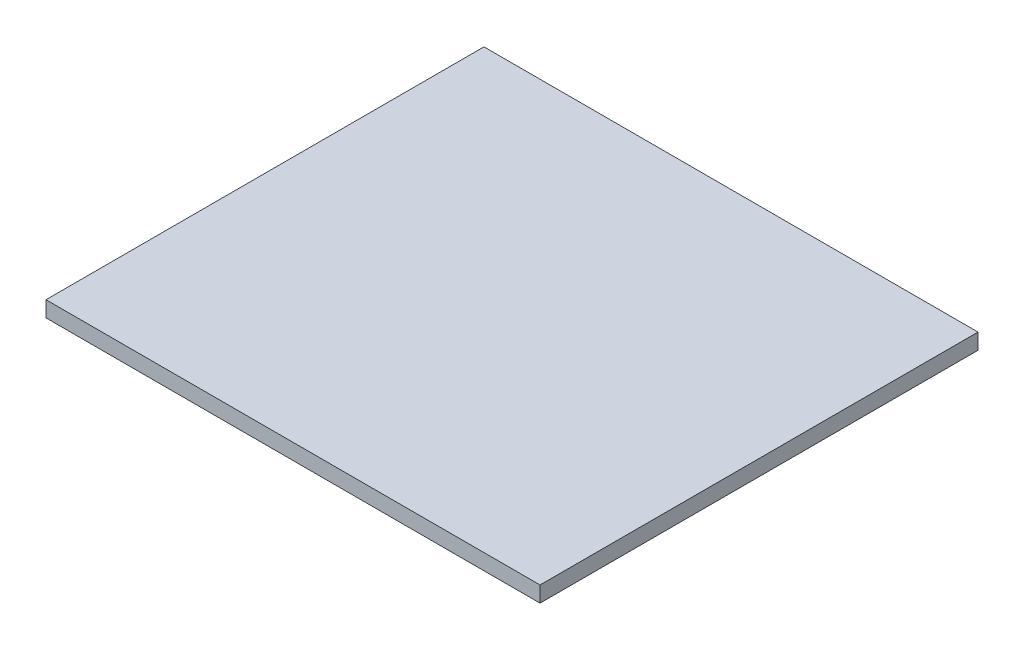
ISO-10303-21;
HEADER;
FILE_DESCRIPTION(('STEP AP214'),'2;1');
FILE_NAME('part.step','',(''),(''),'','','');
FILE_SCHEMA(('AUTOMOTIVE_DESIGN { 1 0 10303 214 1 1 1 1 }'));
ENDSEC;
DATA;
#1=APPLICATION_CONTEXT('core data for automotive mechanical design processes');
#2=APPLICATION_PROTOCOL_DEFINITION('international standard','automotive_design',2000,#1);
#3=PRODUCT_CONTEXT('',#1,'mechanical');
#4=PRODUCT('Part','Part','',(#3));
#5=PRODUCT_RELATED_PRODUCT_CATEGORY('part','',(#4));
#6=PRODUCT_DEFINITION_FORMATION('','',#4);
#7=PRODUCT_DEFINITION_CONTEXT('part definition',#1,'design');
#8=PRODUCT_DEFINITION('design','',#6,#7);
#9=PRODUCT_DEFINITION_SHAPE('','',#8);
#10=(LENGTH_UNIT() NAMED_UNIT(*) SI_UNIT(.MILLI.,.METRE.));
#11=(NAMED_UNIT(*) PLANE_ANGLE_UNIT() SI_UNIT($,.RADIAN.));
#12=(NAMED_UNIT(*) SI_UNIT($,.STERADIAN.) SOLID_ANGLE_UNIT());
#13=UNCERTAINTY_MEASURE_WITH_UNIT(LENGTH_MEASURE(1.E-05),#10,'distance_accuracy_value','');
#14=(GEOMETRIC_REPRESENTATION_CONTEXT(3) GLOBAL_UNCERTAINTY_ASSIGNED_CONTEXT((#13)) GLOBAL_UNIT_ASSIGNED_CONTEXT((#10,
#11,#12)) REPRESENTATION_CONTEXT('',''));
#15=CARTESIAN_POINT('',(0.,0.,0.));
#16=DIRECTION('',(0.,0.,1.));
#17=DIRECTION('',(1.,0.,0.));
#18=AXIS2_PLACEMENT_3D('',#15,#16,#17);
#19=CARTESIAN_POINT('',(-282.,18.,-250.));
#20=DIRECTION('',(1.,0.,0.));
#21=DIRECTION('',(0.,0.,-1.));
#22=AXIS2_PLACEMENT_3D('',#19,#20,#21);
#23=PLANE('',#22);
#24=DIRECTION('',(0.,0.,1.));
#25=VECTOR('',#24,1.);
#26=CARTESIAN_POINT('',(-282.,0.,-250.));
#27=LINE('',#26,#25);
#28=CARTESIAN_POINT('',(-282.,0.,-250.));
#29=VERTEX_POINT('',#28);
#30=CARTESIAN_POINT('',(-282.,0.,250.));
#31=VERTEX_POINT('',#30);
#32=EDGE_CURVE('E98',#29,#31,#27,.T.);
#33=ORIENTED_EDGE('',*,*,#32,.T.);
#34=DIRECTION('',(0.,-1.,0.));
#35=VECTOR('',#34,1.);
#36=CARTESIAN_POINT('',(-282.,18.,250.));
#37=LINE('',#36,#35);
#38=CARTESIAN_POINT('',(-282.,18.,250.));
#39=VERTEX_POINT('',#38);
#40=EDGE_CURVE('E11',#39,#31,#37,.T.);
#41=ORIENTED_EDGE('',*,*,#40,.F.);
#42=DIRECTION('',(0.,0.,1.));
#43=VECTOR('',#42,1.);
#44=CARTESIAN_POINT('',(-282.,18.,-250.));
#45=LINE('',#44,#43);
#46=CARTESIAN_POINT('',(-282.,18.,-250.));
#47=VERTEX_POINT('',#46);
#48=EDGE_CURVE('E86',#47,#39,#45,.T.);
#49=ORIENTED_EDGE('',*,*,#48,.F.);
#50=DIRECTION('',(0.,-1.,0.));
#51=VECTOR('',#50,1.);
#52=CARTESIAN_POINT('',(-282.,18.,-250.));
#53=LINE('',#52,#51);
#54=EDGE_CURVE('E94',#47,#29,#53,.T.);
#55=ORIENTED_EDGE('',*,*,#54,.T.);
#56=EDGE_LOOP('',(#33,#41,#49,#55));
#57=FACE_BOUND('',#56,.T.);
#58=ADVANCED_FACE('F35',(#57),#23,.F.);
#59=CARTESIAN_POINT('',(282.,18.,250.));
#60=DIRECTION('',(0.,0.,-1.));
#61=DIRECTION('',(-1.,0.,0.));
#62=AXIS2_PLACEMENT_3D('',#59,#60,#61);
#63=PLANE('',#62);
#64=DIRECTION('',(1.,0.,0.));
#65=VECTOR('',#64,1.);
#66=CARTESIAN_POINT('',(282.,0.,250.));
#67=LINE('',#66,#65);
#68=CARTESIAN_POINT('',(282.,0.,250.));
#69=VERTEX_POINT('',#68);
#70=EDGE_CURVE('E90',#31,#69,#67,.T.);
#71=ORIENTED_EDGE('',*,*,#70,.T.);
#72=DIRECTION('',(0.,-1.,0.));
#73=VECTOR('',#72,1.);
#74=CARTESIAN_POINT('',(282.,18.,250.));
#75=LINE('',#74,#73);
#76=CARTESIAN_POINT('',(282.,18.,250.));
#77=VERTEX_POINT('',#76);
#78=EDGE_CURVE('E43',#77,#69,#75,.T.);
#79=ORIENTED_EDGE('',*,*,#78,.F.);
#80=DIRECTION('',(1.,0.,0.));
#81=VECTOR('',#80,1.);
#82=CARTESIAN_POINT('',(282.,18.,250.));
#83=LINE('',#82,#81);
#84=EDGE_CURVE('E81',#39,#77,#83,.T.);
#85=ORIENTED_EDGE('',*,*,#84,.F.);
#86=ORIENTED_EDGE('',*,*,#40,.T.);
#87=EDGE_LOOP('',(#71,#79,#85,#86));
#88=FACE_BOUND('',#87,.T.);
#89=ADVANCED_FACE('F89',(#88),#63,.F.);
#90=CARTESIAN_POINT('',(282.,18.,-250.));
#91=DIRECTION('',(-1.,0.,0.));
#92=DIRECTION('',(0.,0.,1.));
#93=AXIS2_PLACEMENT_3D('',#90,#91,#92);
#94=PLANE('',#93);
#95=DIRECTION('',(0.,0.,-1.));
#96=VECTOR('',#95,1.);
#97=CARTESIAN_POINT('',(282.,0.,-250.));
#98=LINE('',#97,#96);
#99=CARTESIAN_POINT('',(282.,0.,-250.));
#100=VERTEX_POINT('',#99);
#101=EDGE_CURVE('E68',#69,#100,#98,.T.);
#102=ORIENTED_EDGE('',*,*,#101,.T.);
#103=DIRECTION('',(0.,-1.,0.));
#104=VECTOR('',#103,1.);
#105=CARTESIAN_POINT('',(282.,18.,-250.));
#106=LINE('',#105,#104);
#107=CARTESIAN_POINT('',(282.,18.,-250.));
#108=VERTEX_POINT('',#107);
#109=EDGE_CURVE('E91',#108,#100,#106,.T.);
#110=ORIENTED_EDGE('',*,*,#109,.F.);
#111=DIRECTION('',(0.,0.,-1.));
#112=VECTOR('',#111,1.);
#113=CARTESIAN_POINT('',(282.,18.,-250.));
#114=LINE('',#113,#112);
#115=EDGE_CURVE('E84',#77,#108,#114,.T.);
#116=ORIENTED_EDGE('',*,*,#115,.F.);
#117=ORIENTED_EDGE('',*,*,#78,.T.);
#118=EDGE_LOOP('',(#102,#110,#116,#117));
#119=FACE_BOUND('',#118,.T.);
#120=ADVANCED_FACE('F92',(#119),#94,.F.);
#121=CARTESIAN_POINT('',(282.,18.,-250.));
#122=DIRECTION('',(0.,0.,1.));
#123=DIRECTION('',(1.,0.,0.));
#124=AXIS2_PLACEMENT_3D('',#121,#122,#123);
#125=PLANE('',#124);
#126=DIRECTION('',(-1.,0.,0.));
#127=VECTOR('',#126,1.);
#128=CARTESIAN_POINT('',(282.,0.,-250.));
#129=LINE('',#128,#127);
#130=EDGE_CURVE('E74',#100,#29,#129,.T.);
#131=ORIENTED_EDGE('',*,*,#130,.T.);
#132=ORIENTED_EDGE('',*,*,#54,.F.);
#133=DIRECTION('',(-1.,0.,0.));
#134=VECTOR('',#133,1.);
#135=CARTESIAN_POINT('',(282.,18.,-250.));
#136=LINE('',#135,#134);
#137=EDGE_CURVE('E51',#108,#47,#136,.T.);
#138=ORIENTED_EDGE('',*,*,#137,.F.);
#139=ORIENTED_EDGE('',*,*,#109,.T.);
#140=EDGE_LOOP('',(#131,#132,#138,#139));
#141=FACE_BOUND('',#140,.T.);
#142=ADVANCED_FACE('F105',(#141),#125,.F.);
#143=CARTESIAN_POINT('',(0.,18.,0.));
#144=DIRECTION('',(0.,-1.,0.));
#145=DIRECTION('',(0.,0.,-1.));
#146=AXIS2_PLACEMENT_3D('',#143,#144,#145);
#147=PLANE('',#146);
#148=ORIENTED_EDGE('',*,*,#48,.T.);
#149=ORIENTED_EDGE('',*,*,#84,.T.);
#150=ORIENTED_EDGE('',*,*,#115,.T.);
#151=ORIENTED_EDGE('',*,*,#137,.T.);
#152=EDGE_LOOP('',(#148,#149,#150,#151));
#153=FACE_BOUND('',#152,.T.);
#154=ADVANCED_FACE('F82',(#153),#147,.F.);
#155=CARTESIAN_POINT('',(0.,0.,0.));
#156=DIRECTION('',(0.,-1.,0.));
#157=DIRECTION('',(0.,0.,-1.));
#158=AXIS2_PLACEMENT_3D('',#155,#156,#157);
#159=PLANE('',#158);
#160=ORIENTED_EDGE('',*,*,#32,.F.);
#161=ORIENTED_EDGE('',*,*,#130,.F.);
#162=ORIENTED_EDGE('',*,*,#101,.F.);
#163=ORIENTED_EDGE('',*,*,#70,.F.);
#164=EDGE_LOOP('',(#160,#161,#162,#163));
#165=FACE_BOUND('',#164,.T.);
#166=ADVANCED_FACE('F108',(#165),#159,.T.);
#167=CLOSED_SHELL('',(#58,#89,#120,#142,#154,#166));
#168=MANIFOLD_SOLID_BREP('B2',#167);
#169=ADVANCED_BREP_SHAPE_REPRESENTATION('',(#18,#168),#14);
#170=SHAPE_DEFINITION_REPRESENTATION(#9,#169);
ENDSEC;
END-ISO-10303-21;
